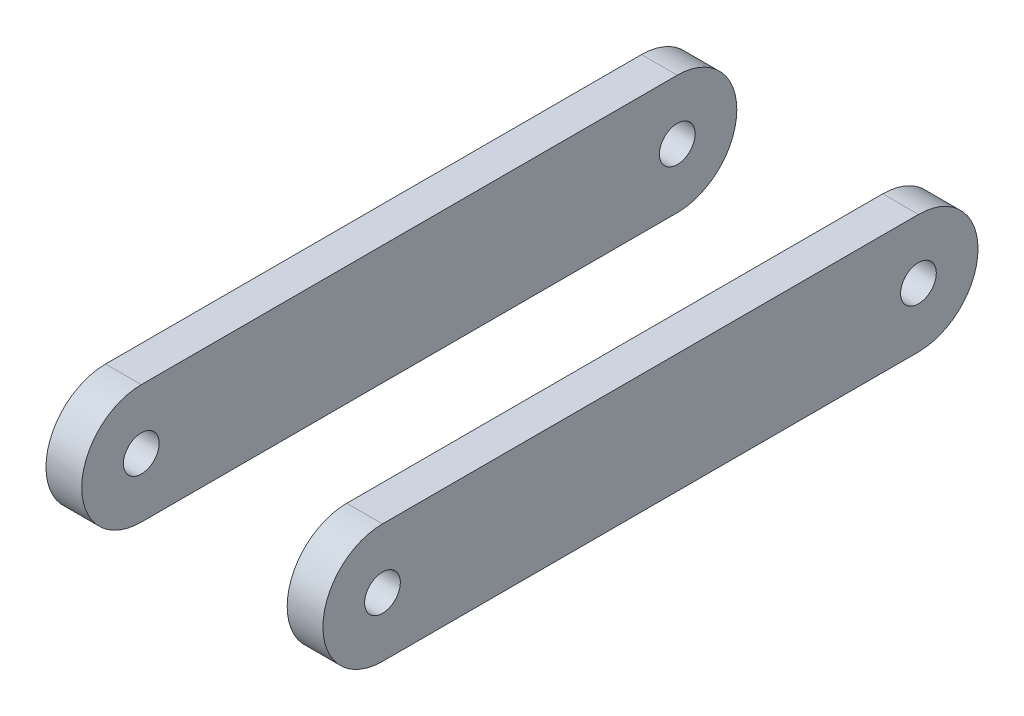
ISO-10303-21;
HEADER;
FILE_DESCRIPTION(('STEP AP214'),'2;1');
FILE_NAME('part.step','',(''),(''),'','','');
FILE_SCHEMA(('AUTOMOTIVE_DESIGN { 1 0 10303 214 1 1 1 1 }'));
ENDSEC;
DATA;
#1=APPLICATION_CONTEXT('core data for automotive mechanical design processes');
#2=APPLICATION_PROTOCOL_DEFINITION('international standard','automotive_design',2000,#1);
#3=PRODUCT_CONTEXT('',#1,'mechanical');
#4=PRODUCT('Part','Part','',(#3));
#5=PRODUCT_RELATED_PRODUCT_CATEGORY('part','',(#4));
#6=PRODUCT_DEFINITION_FORMATION('','',#4);
#7=PRODUCT_DEFINITION_CONTEXT('part definition',#1,'design');
#8=PRODUCT_DEFINITION('design','',#6,#7);
#9=PRODUCT_DEFINITION_SHAPE('','',#8);
#10=(LENGTH_UNIT() NAMED_UNIT(*) SI_UNIT(.MILLI.,.METRE.));
#11=(NAMED_UNIT(*) PLANE_ANGLE_UNIT() SI_UNIT($,.RADIAN.));
#12=(NAMED_UNIT(*) SI_UNIT($,.STERADIAN.) SOLID_ANGLE_UNIT());
#13=UNCERTAINTY_MEASURE_WITH_UNIT(LENGTH_MEASURE(1.E-05),#10,'distance_accuracy_value','');
#14=(GEOMETRIC_REPRESENTATION_CONTEXT(3) GLOBAL_UNCERTAINTY_ASSIGNED_CONTEXT((#13)) GLOBAL_UNIT_ASSIGNED_CONTEXT((#10,
#11,#12)) REPRESENTATION_CONTEXT('',''));
#15=CARTESIAN_POINT('',(0.,0.,0.));
#16=DIRECTION('',(0.,0.,1.));
#17=DIRECTION('',(1.,0.,0.));
#18=AXIS2_PLACEMENT_3D('',#15,#16,#17);
#19=CARTESIAN_POINT('',(-23.25,0.,0.));
#20=DIRECTION('',(1.,0.,0.));
#21=DIRECTION('',(0.,0.,1.));
#22=AXIS2_PLACEMENT_3D('',#19,#20,#21);
#23=CYLINDRICAL_SURFACE('',#22,10.);
#24=CARTESIAN_POINT('',(-17.25,0.,0.));
#25=DIRECTION('',(1.,0.,0.));
#26=DIRECTION('',(0.,0.,-1.));
#27=AXIS2_PLACEMENT_3D('',#24,#25,#26);
#28=CIRCLE('',#27,10.);
#29=CARTESIAN_POINT('',(-17.25,10.,0.));
#30=VERTEX_POINT('',#29);
#31=CARTESIAN_POINT('',(-17.25,-10.,0.));
#32=VERTEX_POINT('',#31);
#33=EDGE_CURVE('E113',#30,#32,#28,.T.);
#34=ORIENTED_EDGE('',*,*,#33,.F.);
#35=DIRECTION('',(1.,0.,0.));
#36=VECTOR('',#35,1.);
#37=CARTESIAN_POINT('',(-23.25,10.,0.));
#38=LINE('',#37,#36);
#39=CARTESIAN_POINT('',(-23.25,10.,0.));
#40=VERTEX_POINT('',#39);
#41=EDGE_CURVE('E112',#40,#30,#38,.T.);
#42=ORIENTED_EDGE('',*,*,#41,.F.);
#43=CARTESIAN_POINT('',(-23.25,0.,0.));
#44=DIRECTION('',(1.,0.,0.));
#45=DIRECTION('',(0.,0.,-1.));
#46=AXIS2_PLACEMENT_3D('',#43,#44,#45);
#47=CIRCLE('',#46,10.);
#48=CARTESIAN_POINT('',(-23.25,-10.,0.));
#49=VERTEX_POINT('',#48);
#50=EDGE_CURVE('E106',#40,#49,#47,.T.);
#51=ORIENTED_EDGE('',*,*,#50,.T.);
#52=DIRECTION('',(1.,0.,0.));
#53=VECTOR('',#52,1.);
#54=CARTESIAN_POINT('',(-23.25,-10.,0.));
#55=LINE('',#54,#53);
#56=EDGE_CURVE('E12',#49,#32,#55,.T.);
#57=ORIENTED_EDGE('',*,*,#56,.T.);
#58=EDGE_LOOP('',(#34,#42,#51,#57));
#59=FACE_BOUND('',#58,.T.);
#60=ADVANCED_FACE('F49',(#59),#23,.T.);
#61=CARTESIAN_POINT('',(-23.25,-10.,0.));
#62=DIRECTION('',(0.,1.,0.));
#63=DIRECTION('',(0.,0.,1.));
#64=AXIS2_PLACEMENT_3D('',#61,#62,#63);
#65=PLANE('',#64);
#66=DIRECTION('',(0.,0.,-1.));
#67=VECTOR('',#66,1.);
#68=CARTESIAN_POINT('',(-17.25,-10.,0.));
#69=LINE('',#68,#67);
#70=CARTESIAN_POINT('',(-17.25,-10.,-90.));
#71=VERTEX_POINT('',#70);
#72=EDGE_CURVE('E115',#32,#71,#69,.T.);
#73=ORIENTED_EDGE('',*,*,#72,.F.);
#74=ORIENTED_EDGE('',*,*,#56,.F.);
#75=DIRECTION('',(0.,0.,-1.));
#76=VECTOR('',#75,1.);
#77=CARTESIAN_POINT('',(-23.25,-10.,0.));
#78=LINE('',#77,#76);
#79=CARTESIAN_POINT('',(-23.25,-10.,-90.));
#80=VERTEX_POINT('',#79);
#81=EDGE_CURVE('E90',#49,#80,#78,.T.);
#82=ORIENTED_EDGE('',*,*,#81,.T.);
#83=DIRECTION('',(1.,0.,0.));
#84=VECTOR('',#83,1.);
#85=CARTESIAN_POINT('',(-23.25,-10.,-90.));
#86=LINE('',#85,#84);
#87=EDGE_CURVE('E57',#80,#71,#86,.T.);
#88=ORIENTED_EDGE('',*,*,#87,.T.);
#89=EDGE_LOOP('',(#73,#74,#82,#88));
#90=FACE_BOUND('',#89,.T.);
#91=ADVANCED_FACE('F104',(#90),#65,.F.);
#92=CARTESIAN_POINT('',(-23.25,0.,-90.));
#93=DIRECTION('',(1.,0.,0.));
#94=DIRECTION('',(0.,0.,1.));
#95=AXIS2_PLACEMENT_3D('',#92,#93,#94);
#96=CYLINDRICAL_SURFACE('',#95,10.);
#97=CARTESIAN_POINT('',(-17.25,0.,-90.));
#98=DIRECTION('',(1.,0.,0.));
#99=DIRECTION('',(0.,0.,-1.));
#100=AXIS2_PLACEMENT_3D('',#97,#98,#99);
#101=CIRCLE('',#100,10.);
#102=CARTESIAN_POINT('',(-17.25,10.,-90.));
#103=VERTEX_POINT('',#102);
#104=EDGE_CURVE('E100',#71,#103,#101,.T.);
#105=ORIENTED_EDGE('',*,*,#104,.F.);
#106=ORIENTED_EDGE('',*,*,#87,.F.);
#107=CARTESIAN_POINT('',(-23.25,0.,-90.));
#108=DIRECTION('',(1.,0.,0.));
#109=DIRECTION('',(0.,0.,-1.));
#110=AXIS2_PLACEMENT_3D('',#107,#108,#109);
#111=CIRCLE('',#110,10.);
#112=CARTESIAN_POINT('',(-23.25,10.,-90.));
#113=VERTEX_POINT('',#112);
#114=EDGE_CURVE('E93',#80,#113,#111,.T.);
#115=ORIENTED_EDGE('',*,*,#114,.T.);
#116=DIRECTION('',(1.,0.,0.));
#117=VECTOR('',#116,1.);
#118=CARTESIAN_POINT('',(-23.25,10.,-90.));
#119=LINE('',#118,#117);
#120=EDGE_CURVE('E103',#113,#103,#119,.T.);
#121=ORIENTED_EDGE('',*,*,#120,.T.);
#122=EDGE_LOOP('',(#105,#106,#115,#121));
#123=FACE_BOUND('',#122,.T.);
#124=ADVANCED_FACE('F99',(#123),#96,.T.);
#125=CARTESIAN_POINT('',(-23.25,10.,0.));
#126=DIRECTION('',(0.,1.,0.));
#127=DIRECTION('',(0.,0.,1.));
#128=AXIS2_PLACEMENT_3D('',#125,#126,#127);
#129=PLANE('',#128);
#130=DIRECTION('',(0.,0.,-1.));
#131=VECTOR('',#130,1.);
#132=CARTESIAN_POINT('',(-17.25,10.,0.));
#133=LINE('',#132,#131);
#134=EDGE_CURVE('E79',#30,#103,#133,.T.);
#135=ORIENTED_EDGE('',*,*,#134,.T.);
#136=ORIENTED_EDGE('',*,*,#120,.F.);
#137=DIRECTION('',(0.,0.,-1.));
#138=VECTOR('',#137,1.);
#139=CARTESIAN_POINT('',(-23.25,10.,0.));
#140=LINE('',#139,#138);
#141=EDGE_CURVE('E65',#40,#113,#140,.T.);
#142=ORIENTED_EDGE('',*,*,#141,.F.);
#143=ORIENTED_EDGE('',*,*,#41,.T.);
#144=EDGE_LOOP('',(#135,#136,#142,#143));
#145=FACE_BOUND('',#144,.T.);
#146=ADVANCED_FACE('F125',(#145),#129,.T.);
#147=CARTESIAN_POINT('',(-23.25,0.,0.));
#148=DIRECTION('',(-1.,0.,0.));
#149=DIRECTION('',(0.,0.,-1.));
#150=AXIS2_PLACEMENT_3D('',#147,#148,#149);
#151=PLANE('',#150);
#152=CARTESIAN_POINT('',(-23.25,0.,0.));
#153=DIRECTION('',(1.,0.,0.));
#154=DIRECTION('',(0.,0.,-1.));
#155=AXIS2_PLACEMENT_3D('',#152,#153,#154);
#156=CIRCLE('',#155,3.00000000000001);
#157=CARTESIAN_POINT('',(-23.25,0.,-3.00000000000001));
#158=VERTEX_POINT('',#157);
#159=EDGE_CURVE('E116',#158,#158,#156,.T.);
#160=ORIENTED_EDGE('',*,*,#159,.T.);
#161=EDGE_LOOP('',(#160));
#162=FACE_BOUND('',#161,.T.);
#163=CARTESIAN_POINT('',(-23.25,0.,-90.));
#164=DIRECTION('',(1.,0.,0.));
#165=DIRECTION('',(0.,0.,-1.));
#166=AXIS2_PLACEMENT_3D('',#163,#164,#165);
#167=CIRCLE('',#166,2.99999999999953);
#168=CARTESIAN_POINT('',(-23.25,0.,-92.9999999999995));
#169=VERTEX_POINT('',#168);
#170=EDGE_CURVE('E196',#169,#169,#167,.T.);
#171=ORIENTED_EDGE('',*,*,#170,.T.);
#172=EDGE_LOOP('',(#171));
#173=FACE_BOUND('',#172,.T.);
#174=ORIENTED_EDGE('',*,*,#50,.F.);
#175=ORIENTED_EDGE('',*,*,#141,.T.);
#176=ORIENTED_EDGE('',*,*,#114,.F.);
#177=ORIENTED_EDGE('',*,*,#81,.F.);
#178=EDGE_LOOP('',(#174,#175,#176,#177));
#179=FACE_BOUND('',#178,.T.);
#180=ADVANCED_FACE('F95',(#162,#173,#179),#151,.T.);
#181=CARTESIAN_POINT('',(-17.25,0.,0.));
#182=DIRECTION('',(-1.,0.,0.));
#183=DIRECTION('',(0.,0.,-1.));
#184=AXIS2_PLACEMENT_3D('',#181,#182,#183);
#185=PLANE('',#184);
#186=CARTESIAN_POINT('',(-17.25,0.,0.));
#187=DIRECTION('',(1.,0.,0.));
#188=DIRECTION('',(0.,0.,-1.));
#189=AXIS2_PLACEMENT_3D('',#186,#187,#188);
#190=CIRCLE('',#189,3.00000000000001);
#191=CARTESIAN_POINT('',(-17.25,0.,-3.00000000000001));
#192=VERTEX_POINT('',#191);
#193=EDGE_CURVE('E195',#192,#192,#190,.T.);
#194=ORIENTED_EDGE('',*,*,#193,.F.);
#195=EDGE_LOOP('',(#194));
#196=FACE_BOUND('',#195,.T.);
#197=CARTESIAN_POINT('',(-17.25,0.,-90.));
#198=DIRECTION('',(1.,0.,0.));
#199=DIRECTION('',(0.,0.,-1.));
#200=AXIS2_PLACEMENT_3D('',#197,#198,#199);
#201=CIRCLE('',#200,2.99999999999953);
#202=CARTESIAN_POINT('',(-17.25,0.,-92.9999999999995));
#203=VERTEX_POINT('',#202);
#204=EDGE_CURVE('E197',#203,#203,#201,.T.);
#205=ORIENTED_EDGE('',*,*,#204,.F.);
#206=EDGE_LOOP('',(#205));
#207=FACE_BOUND('',#206,.T.);
#208=ORIENTED_EDGE('',*,*,#33,.T.);
#209=ORIENTED_EDGE('',*,*,#72,.T.);
#210=ORIENTED_EDGE('',*,*,#104,.T.);
#211=ORIENTED_EDGE('',*,*,#134,.F.);
#212=EDGE_LOOP('',(#208,#209,#210,#211));
#213=FACE_BOUND('',#212,.T.);
#214=ADVANCED_FACE('F121',(#196,#207,#213),#185,.F.);
#215=CARTESIAN_POINT('',(-17.25,0.,-90.));
#216=DIRECTION('',(-1.,0.,0.));
#217=DIRECTION('',(0.,0.,-1.));
#218=AXIS2_PLACEMENT_3D('',#215,#216,#217);
#219=CYLINDRICAL_SURFACE('',#218,2.99999999999953);
#220=ORIENTED_EDGE('',*,*,#170,.F.);
#221=EDGE_LOOP('',(#220));
#222=FACE_BOUND('',#221,.T.);
#223=ORIENTED_EDGE('',*,*,#204,.T.);
#224=EDGE_LOOP('',(#223));
#225=FACE_BOUND('',#224,.T.);
#226=ADVANCED_FACE('F167',(#222,#225),#219,.F.);
#227=CARTESIAN_POINT('',(-17.25,0.,0.));
#228=DIRECTION('',(-1.,0.,0.));
#229=DIRECTION('',(0.,0.,-1.));
#230=AXIS2_PLACEMENT_3D('',#227,#228,#229);
#231=CYLINDRICAL_SURFACE('',#230,3.00000000000001);
#232=ORIENTED_EDGE('',*,*,#159,.F.);
#233=EDGE_LOOP('',(#232));
#234=FACE_BOUND('',#233,.T.);
#235=ORIENTED_EDGE('',*,*,#193,.T.);
#236=EDGE_LOOP('',(#235));
#237=FACE_BOUND('',#236,.T.);
#238=ADVANCED_FACE('F176',(#234,#237),#231,.F.);
#239=CLOSED_SHELL('',(#60,#91,#124,#146,#180,#214,#226,#238));
#240=MANIFOLD_SOLID_BREP('B2',#239);
#241=CARTESIAN_POINT('',(23.25,0.,0.));
#242=DIRECTION('',(-1.,0.,0.));
#243=DIRECTION('',(0.,0.,1.));
#244=AXIS2_PLACEMENT_3D('',#241,#242,#243);
#245=CYLINDRICAL_SURFACE('',#244,10.);
#246=CARTESIAN_POINT('',(17.25,0.,0.));
#247=DIRECTION('',(1.,0.,0.));
#248=DIRECTION('',(0.,0.,-1.));
#249=AXIS2_PLACEMENT_3D('',#246,#247,#248);
#250=CIRCLE('',#249,10.);
#251=CARTESIAN_POINT('',(17.25,10.,0.));
#252=VERTEX_POINT('',#251);
#253=CARTESIAN_POINT('',(17.25,-10.,0.));
#254=VERTEX_POINT('',#253);
#255=EDGE_CURVE('E278',#252,#254,#250,.T.);
#256=ORIENTED_EDGE('',*,*,#255,.T.);
#257=DIRECTION('',(-1.,0.,0.));
#258=VECTOR('',#257,1.);
#259=CARTESIAN_POINT('',(23.25,-10.,0.));
#260=LINE('',#259,#258);
#261=CARTESIAN_POINT('',(23.25,-10.,0.));
#262=VERTEX_POINT('',#261);
#263=EDGE_CURVE('E47',#262,#254,#260,.T.);
#264=ORIENTED_EDGE('',*,*,#263,.F.);
#265=CARTESIAN_POINT('',(23.25,0.,0.));
#266=DIRECTION('',(1.,0.,0.));
#267=DIRECTION('',(0.,0.,-1.));
#268=AXIS2_PLACEMENT_3D('',#265,#266,#267);
#269=CIRCLE('',#268,10.);
#270=CARTESIAN_POINT('',(23.25,10.,0.));
#271=VERTEX_POINT('',#270);
#272=EDGE_CURVE('E264',#271,#262,#269,.T.);
#273=ORIENTED_EDGE('',*,*,#272,.F.);
#274=DIRECTION('',(-1.,0.,0.));
#275=VECTOR('',#274,1.);
#276=CARTESIAN_POINT('',(23.25,10.,0.));
#277=LINE('',#276,#275);
#278=EDGE_CURVE('E231',#271,#252,#277,.T.);
#279=ORIENTED_EDGE('',*,*,#278,.T.);
#280=EDGE_LOOP('',(#256,#264,#273,#279));
#281=FACE_BOUND('',#280,.T.);
#282=ADVANCED_FACE('F215',(#281),#245,.T.);
#283=CARTESIAN_POINT('',(23.25,-10.,0.));
#284=DIRECTION('',(0.,1.,0.));
#285=DIRECTION('',(0.,0.,1.));
#286=AXIS2_PLACEMENT_3D('',#283,#284,#285);
#287=PLANE('',#286);
#288=DIRECTION('',(0.,0.,-1.));
#289=VECTOR('',#288,1.);
#290=CARTESIAN_POINT('',(17.25,-10.,0.));
#291=LINE('',#290,#289);
#292=CARTESIAN_POINT('',(17.25,-10.,-90.));
#293=VERTEX_POINT('',#292);
#294=EDGE_CURVE('E269',#254,#293,#291,.T.);
#295=ORIENTED_EDGE('',*,*,#294,.T.);
#296=DIRECTION('',(-1.,0.,0.));
#297=VECTOR('',#296,1.);
#298=CARTESIAN_POINT('',(23.25,-10.,-90.));
#299=LINE('',#298,#297);
#300=CARTESIAN_POINT('',(23.25,-10.,-90.));
#301=VERTEX_POINT('',#300);
#302=EDGE_CURVE('E223',#301,#293,#299,.T.);
#303=ORIENTED_EDGE('',*,*,#302,.F.);
#304=DIRECTION('',(0.,0.,-1.));
#305=VECTOR('',#304,1.);
#306=CARTESIAN_POINT('',(23.25,-10.,0.));
#307=LINE('',#306,#305);
#308=EDGE_CURVE('E257',#262,#301,#307,.T.);
#309=ORIENTED_EDGE('',*,*,#308,.F.);
#310=ORIENTED_EDGE('',*,*,#263,.T.);
#311=EDGE_LOOP('',(#295,#303,#309,#310));
#312=FACE_BOUND('',#311,.T.);
#313=ADVANCED_FACE('F268',(#312),#287,.F.);
#314=CARTESIAN_POINT('',(23.25,0.,-90.));
#315=DIRECTION('',(-1.,0.,0.));
#316=DIRECTION('',(0.,0.,1.));
#317=AXIS2_PLACEMENT_3D('',#314,#315,#316);
#318=CYLINDRICAL_SURFACE('',#317,10.);
#319=CARTESIAN_POINT('',(17.25,0.,-90.));
#320=DIRECTION('',(1.,0.,0.));
#321=DIRECTION('',(0.,0.,-1.));
#322=AXIS2_PLACEMENT_3D('',#319,#320,#321);
#323=CIRCLE('',#322,10.);
#324=CARTESIAN_POINT('',(17.25,10.,-90.));
#325=VERTEX_POINT('',#324);
#326=EDGE_CURVE('E282',#293,#325,#323,.T.);
#327=ORIENTED_EDGE('',*,*,#326,.T.);
#328=DIRECTION('',(-1.,0.,0.));
#329=VECTOR('',#328,1.);
#330=CARTESIAN_POINT('',(23.25,10.,-90.));
#331=LINE('',#330,#329);
#332=CARTESIAN_POINT('',(23.25,10.,-90.));
#333=VERTEX_POINT('',#332);
#334=EDGE_CURVE('E246',#333,#325,#331,.T.);
#335=ORIENTED_EDGE('',*,*,#334,.F.);
#336=CARTESIAN_POINT('',(23.25,0.,-90.));
#337=DIRECTION('',(1.,0.,0.));
#338=DIRECTION('',(0.,0.,-1.));
#339=AXIS2_PLACEMENT_3D('',#336,#337,#338);
#340=CIRCLE('',#339,10.);
#341=EDGE_CURVE('E263',#301,#333,#340,.T.);
#342=ORIENTED_EDGE('',*,*,#341,.F.);
#343=ORIENTED_EDGE('',*,*,#302,.T.);
#344=EDGE_LOOP('',(#327,#335,#342,#343));
#345=FACE_BOUND('',#344,.T.);
#346=ADVANCED_FACE('F272',(#345),#318,.T.);
#347=CARTESIAN_POINT('',(23.25,10.,0.));
#348=DIRECTION('',(0.,1.,0.));
#349=DIRECTION('',(0.,0.,1.));
#350=AXIS2_PLACEMENT_3D('',#347,#348,#349);
#351=PLANE('',#350);
#352=DIRECTION('',(0.,0.,-1.));
#353=VECTOR('',#352,1.);
#354=CARTESIAN_POINT('',(17.25,10.,0.));
#355=LINE('',#354,#353);
#356=EDGE_CURVE('E284',#252,#325,#355,.T.);
#357=ORIENTED_EDGE('',*,*,#356,.F.);
#358=ORIENTED_EDGE('',*,*,#278,.F.);
#359=DIRECTION('',(0.,0.,-1.));
#360=VECTOR('',#359,1.);
#361=CARTESIAN_POINT('',(23.25,10.,0.));
#362=LINE('',#361,#360);
#363=EDGE_CURVE('E273',#271,#333,#362,.T.);
#364=ORIENTED_EDGE('',*,*,#363,.T.);
#365=ORIENTED_EDGE('',*,*,#334,.T.);
#366=EDGE_LOOP('',(#357,#358,#364,#365));
#367=FACE_BOUND('',#366,.T.);
#368=ADVANCED_FACE('F319',(#367),#351,.T.);
#369=CARTESIAN_POINT('',(23.25,0.,0.));
#370=DIRECTION('',(1.,0.,0.));
#371=DIRECTION('',(0.,0.,-1.));
#372=AXIS2_PLACEMENT_3D('',#369,#370,#371);
#373=PLANE('',#372);
#374=CARTESIAN_POINT('',(23.25,0.,0.));
#375=DIRECTION('',(1.,0.,0.));
#376=DIRECTION('',(0.,0.,-1.));
#377=AXIS2_PLACEMENT_3D('',#374,#375,#376);
#378=CIRCLE('',#377,3.00000000000001);
#379=CARTESIAN_POINT('',(23.25,0.,-3.00000000000001));
#380=VERTEX_POINT('',#379);
#381=EDGE_CURVE('E280',#380,#380,#378,.T.);
#382=ORIENTED_EDGE('',*,*,#381,.F.);
#383=EDGE_LOOP('',(#382));
#384=FACE_BOUND('',#383,.T.);
#385=CARTESIAN_POINT('',(23.25,0.,-90.));
#386=DIRECTION('',(1.,0.,0.));
#387=DIRECTION('',(0.,0.,-1.));
#388=AXIS2_PLACEMENT_3D('',#385,#386,#387);
#389=CIRCLE('',#388,2.99999999999953);
#390=CARTESIAN_POINT('',(23.25,0.,-92.9999999999995));
#391=VERTEX_POINT('',#390);
#392=EDGE_CURVE('E292',#391,#391,#389,.T.);
#393=ORIENTED_EDGE('',*,*,#392,.F.);
#394=EDGE_LOOP('',(#393));
#395=FACE_BOUND('',#394,.T.);
#396=ORIENTED_EDGE('',*,*,#272,.T.);
#397=ORIENTED_EDGE('',*,*,#308,.T.);
#398=ORIENTED_EDGE('',*,*,#341,.T.);
#399=ORIENTED_EDGE('',*,*,#363,.F.);
#400=EDGE_LOOP('',(#396,#397,#398,#399));
#401=FACE_BOUND('',#400,.T.);
#402=ADVANCED_FACE('F260',(#384,#395,#401),#373,.T.);
#403=CARTESIAN_POINT('',(17.25,0.,0.));
#404=DIRECTION('',(1.,0.,0.));
#405=DIRECTION('',(0.,0.,-1.));
#406=AXIS2_PLACEMENT_3D('',#403,#404,#405);
#407=PLANE('',#406);
#408=CARTESIAN_POINT('',(17.25,0.,0.));
#409=DIRECTION('',(1.,0.,0.));
#410=DIRECTION('',(0.,0.,-1.));
#411=AXIS2_PLACEMENT_3D('',#408,#409,#410);
#412=CIRCLE('',#411,3.00000000000001);
#413=CARTESIAN_POINT('',(17.25,0.,-3.00000000000001));
#414=VERTEX_POINT('',#413);
#415=EDGE_CURVE('E295',#414,#414,#412,.T.);
#416=ORIENTED_EDGE('',*,*,#415,.T.);
#417=EDGE_LOOP('',(#416));
#418=FACE_BOUND('',#417,.T.);
#419=CARTESIAN_POINT('',(17.25,0.,-90.));
#420=DIRECTION('',(1.,0.,0.));
#421=DIRECTION('',(0.,0.,-1.));
#422=AXIS2_PLACEMENT_3D('',#419,#420,#421);
#423=CIRCLE('',#422,2.99999999999953);
#424=CARTESIAN_POINT('',(17.25,0.,-92.9999999999995));
#425=VERTEX_POINT('',#424);
#426=EDGE_CURVE('E296',#425,#425,#423,.T.);
#427=ORIENTED_EDGE('',*,*,#426,.T.);
#428=EDGE_LOOP('',(#427));
#429=FACE_BOUND('',#428,.T.);
#430=ORIENTED_EDGE('',*,*,#255,.F.);
#431=ORIENTED_EDGE('',*,*,#356,.T.);
#432=ORIENTED_EDGE('',*,*,#326,.F.);
#433=ORIENTED_EDGE('',*,*,#294,.F.);
#434=EDGE_LOOP('',(#430,#431,#432,#433));
#435=FACE_BOUND('',#434,.T.);
#436=ADVANCED_FACE('F302',(#418,#429,#435),#407,.F.);
#437=CARTESIAN_POINT('',(17.25,0.,-90.));
#438=DIRECTION('',(1.,0.,0.));
#439=DIRECTION('',(0.,0.,-1.));
#440=AXIS2_PLACEMENT_3D('',#437,#438,#439);
#441=CYLINDRICAL_SURFACE('',#440,2.99999999999953);
#442=ORIENTED_EDGE('',*,*,#392,.T.);
#443=EDGE_LOOP('',(#442));
#444=FACE_BOUND('',#443,.T.);
#445=ORIENTED_EDGE('',*,*,#426,.F.);
#446=EDGE_LOOP('',(#445));
#447=FACE_BOUND('',#446,.T.);
#448=ADVANCED_FACE('F307',(#444,#447),#441,.F.);
#449=CARTESIAN_POINT('',(17.25,0.,0.));
#450=DIRECTION('',(1.,0.,0.));
#451=DIRECTION('',(0.,0.,-1.));
#452=AXIS2_PLACEMENT_3D('',#449,#450,#451);
#453=CYLINDRICAL_SURFACE('',#452,3.00000000000001);
#454=ORIENTED_EDGE('',*,*,#381,.T.);
#455=EDGE_LOOP('',(#454));
#456=FACE_BOUND('',#455,.T.);
#457=ORIENTED_EDGE('',*,*,#415,.F.);
#458=EDGE_LOOP('',(#457));
#459=FACE_BOUND('',#458,.T.);
#460=ADVANCED_FACE('F305',(#456,#459),#453,.F.);
#461=CLOSED_SHELL('',(#282,#313,#346,#368,#402,#436,#448,#460));
#462=MANIFOLD_SOLID_BREP('B6',#461);
#463=ADVANCED_BREP_SHAPE_REPRESENTATION('',(#18,#240,#462),#14);
#464=SHAPE_DEFINITION_REPRESENTATION(#9,#463);
ENDSEC;
END-ISO-10303-21;
